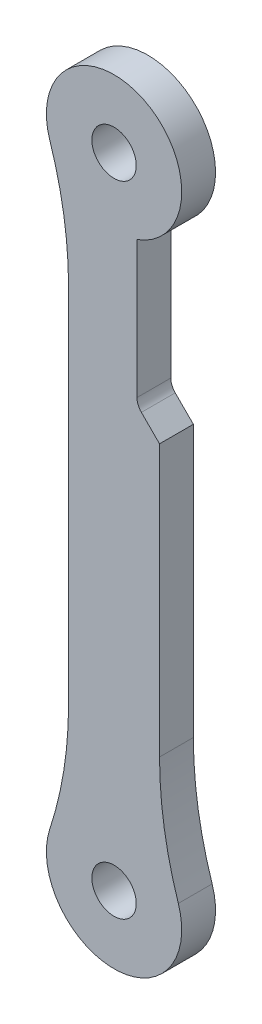
ISO-10303-21;
HEADER;
FILE_DESCRIPTION(('STEP AP214'),'2;1');
FILE_NAME('part.step','',(''),(''),'','','');
FILE_SCHEMA(('AUTOMOTIVE_DESIGN { 1 0 10303 214 1 1 1 1 }'));
ENDSEC;
DATA;
#1=APPLICATION_CONTEXT('core data for automotive mechanical design processes');
#2=APPLICATION_PROTOCOL_DEFINITION('international standard','automotive_design',2000,#1);
#3=PRODUCT_CONTEXT('',#1,'mechanical');
#4=PRODUCT('Part','Part','',(#3));
#5=PRODUCT_RELATED_PRODUCT_CATEGORY('part','',(#4));
#6=PRODUCT_DEFINITION_FORMATION('','',#4);
#7=PRODUCT_DEFINITION_CONTEXT('part definition',#1,'design');
#8=PRODUCT_DEFINITION('design','',#6,#7);
#9=PRODUCT_DEFINITION_SHAPE('','',#8);
#10=(LENGTH_UNIT() NAMED_UNIT(*) SI_UNIT(.MILLI.,.METRE.));
#11=(NAMED_UNIT(*) PLANE_ANGLE_UNIT() SI_UNIT($,.RADIAN.));
#12=(NAMED_UNIT(*) SI_UNIT($,.STERADIAN.) SOLID_ANGLE_UNIT());
#13=UNCERTAINTY_MEASURE_WITH_UNIT(LENGTH_MEASURE(1.E-05),#10,'distance_accuracy_value','');
#14=(GEOMETRIC_REPRESENTATION_CONTEXT(3) GLOBAL_UNCERTAINTY_ASSIGNED_CONTEXT((#13)) GLOBAL_UNIT_ASSIGNED_CONTEXT((#10,
#11,#12)) REPRESENTATION_CONTEXT('',''));
#15=CARTESIAN_POINT('',(0.,0.,0.));
#16=DIRECTION('',(0.,0.,1.));
#17=DIRECTION('',(1.,0.,0.));
#18=AXIS2_PLACEMENT_3D('',#15,#16,#17);
#19=CARTESIAN_POINT('',(-6.05000000000002,-42.5,-2.));
#20=DIRECTION('',(-1.,0.,0.));
#21=DIRECTION('',(0.,-1.,0.));
#22=AXIS2_PLACEMENT_3D('',#19,#20,#21);
#23=PLANE('',#22);
#24=DIRECTION('',(0.,-1.,0.));
#25=VECTOR('',#24,1.);
#26=CARTESIAN_POINT('',(-6.05000000000002,-42.5,2.5));
#27=LINE('',#26,#25);
#28=CARTESIAN_POINT('',(-6.05000000000003,24.0772559047248,2.5));
#29=VERTEX_POINT('',#28);
#30=CARTESIAN_POINT('',(-6.05000000000002,-24.0772559047248,2.5));
#31=VERTEX_POINT('',#30);
#32=EDGE_CURVE('E217',#29,#31,#27,.T.);
#33=ORIENTED_EDGE('',*,*,#32,.F.);
#34=DIRECTION('',(0.,0.,1.));
#35=VECTOR('',#34,1.);
#36=CARTESIAN_POINT('',(-6.05000000000003,24.0772559047248,-2.));
#37=LINE('',#36,#35);
#38=CARTESIAN_POINT('',(-6.05000000000003,24.0772559047248,-2.));
#39=VERTEX_POINT('',#38);
#40=EDGE_CURVE('E180',#29,#39,#37,.F.);
#41=ORIENTED_EDGE('',*,*,#40,.T.);
#42=DIRECTION('',(0.,-1.,0.));
#43=VECTOR('',#42,1.);
#44=CARTESIAN_POINT('',(-6.05000000000002,-42.5,-2.));
#45=LINE('',#44,#43);
#46=CARTESIAN_POINT('',(-6.05000000000002,-24.0772559047248,-2.));
#47=VERTEX_POINT('',#46);
#48=EDGE_CURVE('E155',#39,#47,#45,.T.);
#49=ORIENTED_EDGE('',*,*,#48,.T.);
#50=DIRECTION('',(0.,0.,1.));
#51=VECTOR('',#50,1.);
#52=CARTESIAN_POINT('',(-6.05000000000002,-24.0772559047248,2.5));
#53=LINE('',#52,#51);
#54=EDGE_CURVE('E177',#47,#31,#53,.T.);
#55=ORIENTED_EDGE('',*,*,#54,.T.);
#56=EDGE_LOOP('',(#33,#41,#49,#55));
#57=FACE_BOUND('',#56,.T.);
#58=ADVANCED_FACE('F41',(#57),#23,.T.);
#59=CARTESIAN_POINT('',(6.05000000000002,-42.5,-2.));
#60=DIRECTION('',(1.,0.,0.));
#61=DIRECTION('',(0.,1.,0.));
#62=AXIS2_PLACEMENT_3D('',#59,#60,#61);
#63=PLANE('',#62);
#64=DIRECTION('',(0.,1.,0.));
#65=VECTOR('',#64,1.);
#66=CARTESIAN_POINT('',(6.05000000000002,-42.5,2.5));
#67=LINE('',#66,#65);
#68=CARTESIAN_POINT('',(6.05000000000001,-24.0772559047248,2.5));
#69=VERTEX_POINT('',#68);
#70=CARTESIAN_POINT('',(6.05000000000001,12.,2.5));
#71=VERTEX_POINT('',#70);
#72=EDGE_CURVE('E235',#69,#71,#67,.T.);
#73=ORIENTED_EDGE('',*,*,#72,.F.);
#74=DIRECTION('',(0.,0.,1.));
#75=VECTOR('',#74,1.);
#76=CARTESIAN_POINT('',(6.05000000000001,-24.0772559047248,-2.));
#77=LINE('',#76,#75);
#78=CARTESIAN_POINT('',(6.05000000000001,-24.0772559047248,-2.));
#79=VERTEX_POINT('',#78);
#80=EDGE_CURVE('E184',#69,#79,#77,.F.);
#81=ORIENTED_EDGE('',*,*,#80,.T.);
#82=DIRECTION('',(0.,1.,0.));
#83=VECTOR('',#82,1.);
#84=CARTESIAN_POINT('',(6.05000000000002,-42.5,-2.));
#85=LINE('',#84,#83);
#86=CARTESIAN_POINT('',(6.05000000000001,12.,-2.));
#87=VERTEX_POINT('',#86);
#88=EDGE_CURVE('E162',#79,#87,#85,.T.);
#89=ORIENTED_EDGE('',*,*,#88,.T.);
#90=DIRECTION('',(0.,0.,1.));
#91=VECTOR('',#90,1.);
#92=CARTESIAN_POINT('',(6.05000000000001,12.,2.5));
#93=LINE('',#92,#91);
#94=EDGE_CURVE('E158',#87,#71,#93,.T.);
#95=ORIENTED_EDGE('',*,*,#94,.T.);
#96=EDGE_LOOP('',(#73,#81,#89,#95));
#97=FACE_BOUND('',#96,.T.);
#98=ADVANCED_FACE('F248',(#97),#63,.T.);
#99=CARTESIAN_POINT('',(0.,-42.5,-2.));
#100=DIRECTION('',(0.,0.,1.));
#101=DIRECTION('',(1.,0.,0.));
#102=AXIS2_PLACEMENT_3D('',#99,#100,#101);
#103=PLANE('',#102);
#104=ORIENTED_EDGE('',*,*,#88,.F.);
#105=CARTESIAN_POINT('',(56.05,-24.0772559047248,-2.));
#106=DIRECTION('',(0.,0.,1.));
#107=DIRECTION('',(1.,0.,0.));
#108=AXIS2_PLACEMENT_3D('',#105,#106,#107);
#109=CIRCLE('',#108,50.);
#110=CARTESIAN_POINT('',(8.55,-39.6897509007207,-2.));
#111=VERTEX_POINT('',#110);
#112=EDGE_CURVE('E68',#79,#111,#109,.T.);
#113=ORIENTED_EDGE('',*,*,#112,.T.);
#114=CARTESIAN_POINT('',(0.,-42.5,-2.));
#115=DIRECTION('',(0.,0.,-1.));
#116=DIRECTION('',(-1.,0.,0.));
#117=AXIS2_PLACEMENT_3D('',#114,#115,#116);
#118=CIRCLE('',#117,9.);
#119=CARTESIAN_POINT('',(-8.55,-39.6897509007207,-2.));
#120=VERTEX_POINT('',#119);
#121=EDGE_CURVE('E207',#111,#120,#118,.T.);
#122=ORIENTED_EDGE('',*,*,#121,.T.);
#123=CARTESIAN_POINT('',(-56.05,-24.0772559047248,-2.));
#124=DIRECTION('',(0.,0.,1.));
#125=DIRECTION('',(1.,0.,0.));
#126=AXIS2_PLACEMENT_3D('',#123,#124,#125);
#127=CIRCLE('',#126,50.);
#128=EDGE_CURVE('E50',#120,#47,#127,.T.);
#129=ORIENTED_EDGE('',*,*,#128,.T.);
#130=ORIENTED_EDGE('',*,*,#48,.F.);
#131=CARTESIAN_POINT('',(-56.05,24.0772559047248,-2.));
#132=DIRECTION('',(0.,0.,1.));
#133=DIRECTION('',(1.,0.,0.));
#134=AXIS2_PLACEMENT_3D('',#131,#132,#133);
#135=CIRCLE('',#134,50.);
#136=CARTESIAN_POINT('',(-8.55000000000002,39.6897509007207,-2.));
#137=VERTEX_POINT('',#136);
#138=EDGE_CURVE('E194',#39,#137,#135,.T.);
#139=ORIENTED_EDGE('',*,*,#138,.T.);
#140=CARTESIAN_POINT('',(0.,42.5,-2.));
#141=DIRECTION('',(0.,0.,-1.));
#142=DIRECTION('',(-1.,0.,0.));
#143=AXIS2_PLACEMENT_3D('',#140,#141,#142);
#144=CIRCLE('',#143,9.);
#145=CARTESIAN_POINT('',(3.05000000000001,34.0325623710594,-2.));
#146=VERTEX_POINT('',#145);
#147=EDGE_CURVE('E138',#137,#146,#144,.T.);
#148=ORIENTED_EDGE('',*,*,#147,.T.);
#149=DIRECTION('',(0.,1.,0.));
#150=VECTOR('',#149,1.);
#151=CARTESIAN_POINT('',(3.05000000000002,38.5,-2.));
#152=LINE('',#151,#150);
#153=CARTESIAN_POINT('',(3.05000000000001,15.8284271247462,-2.));
#154=VERTEX_POINT('',#153);
#155=EDGE_CURVE('E146',#154,#146,#152,.T.);
#156=ORIENTED_EDGE('',*,*,#155,.F.);
#157=CARTESIAN_POINT('',(5.05000000000001,15.8284271247462,-2.));
#158=DIRECTION('',(0.,0.,1.));
#159=DIRECTION('',(1.,0.,0.));
#160=AXIS2_PLACEMENT_3D('',#157,#158,#159);
#161=CIRCLE('',#160,2.);
#162=CARTESIAN_POINT('',(3.63578643762691,14.4142135623731,-2.));
#163=VERTEX_POINT('',#162);
#164=EDGE_CURVE('E174',#154,#163,#161,.T.);
#165=ORIENTED_EDGE('',*,*,#164,.T.);
#166=DIRECTION('',(0.707106781186546,-0.707106781186549,0.));
#167=VECTOR('',#166,1.);
#168=CARTESIAN_POINT('',(3.05,15.,-2.));
#169=LINE('',#168,#167);
#170=EDGE_CURVE('E154',#163,#87,#169,.T.);
#171=ORIENTED_EDGE('',*,*,#170,.T.);
#172=EDGE_LOOP('',(#104,#113,#122,#129,#130,#139,#148,#156,#165,#171));
#173=FACE_BOUND('',#172,.T.);
#174=CARTESIAN_POINT('',(0.,-42.5,-2.));
#175=DIRECTION('',(0.,0.,1.));
#176=DIRECTION('',(1.,0.,0.));
#177=AXIS2_PLACEMENT_3D('',#174,#175,#176);
#178=CIRCLE('',#177,2.95);
#179=CARTESIAN_POINT('',(2.95,-42.5,-2.));
#180=VERTEX_POINT('',#179);
#181=EDGE_CURVE('E240',#180,#180,#178,.T.);
#182=ORIENTED_EDGE('',*,*,#181,.T.);
#183=EDGE_LOOP('',(#182));
#184=FACE_BOUND('',#183,.T.);
#185=CARTESIAN_POINT('',(0.,42.5,-2.));
#186=DIRECTION('',(0.,0.,1.));
#187=DIRECTION('',(1.,0.,0.));
#188=AXIS2_PLACEMENT_3D('',#185,#186,#187);
#189=CIRCLE('',#188,2.95);
#190=CARTESIAN_POINT('',(2.94999999999999,42.5,-2.));
#191=VERTEX_POINT('',#190);
#192=EDGE_CURVE('E243',#191,#191,#189,.T.);
#193=ORIENTED_EDGE('',*,*,#192,.T.);
#194=EDGE_LOOP('',(#193));
#195=FACE_BOUND('',#194,.T.);
#196=ADVANCED_FACE('F205',(#173,#184,#195),#103,.F.);
#197=CARTESIAN_POINT('',(0.,42.5,-2.));
#198=DIRECTION('',(0.,0.,1.));
#199=DIRECTION('',(1.,0.,0.));
#200=AXIS2_PLACEMENT_3D('',#197,#198,#199);
#201=CYLINDRICAL_SURFACE('',#200,2.95);
#202=ORIENTED_EDGE('',*,*,#192,.F.);
#203=EDGE_LOOP('',(#202));
#204=FACE_BOUND('',#203,.T.);
#205=CARTESIAN_POINT('',(0.,42.5,2.5));
#206=DIRECTION('',(0.,0.,1.));
#207=DIRECTION('',(1.,0.,0.));
#208=AXIS2_PLACEMENT_3D('',#205,#206,#207);
#209=CIRCLE('',#208,2.95);
#210=CARTESIAN_POINT('',(2.94999999999999,42.5,2.5));
#211=VERTEX_POINT('',#210);
#212=EDGE_CURVE('E232',#211,#211,#209,.T.);
#213=ORIENTED_EDGE('',*,*,#212,.T.);
#214=EDGE_LOOP('',(#213));
#215=FACE_BOUND('',#214,.T.);
#216=ADVANCED_FACE('F294',(#204,#215),#201,.F.);
#217=CARTESIAN_POINT('',(0.,-42.5,-2.));
#218=DIRECTION('',(0.,0.,1.));
#219=DIRECTION('',(1.,0.,0.));
#220=AXIS2_PLACEMENT_3D('',#217,#218,#219);
#221=CYLINDRICAL_SURFACE('',#220,2.95);
#222=ORIENTED_EDGE('',*,*,#181,.F.);
#223=EDGE_LOOP('',(#222));
#224=FACE_BOUND('',#223,.T.);
#225=CARTESIAN_POINT('',(0.,-42.5,2.5));
#226=DIRECTION('',(0.,0.,1.));
#227=DIRECTION('',(1.,0.,0.));
#228=AXIS2_PLACEMENT_3D('',#225,#226,#227);
#229=CIRCLE('',#228,2.95);
#230=CARTESIAN_POINT('',(2.95,-42.5,2.5));
#231=VERTEX_POINT('',#230);
#232=EDGE_CURVE('E229',#231,#231,#229,.T.);
#233=ORIENTED_EDGE('',*,*,#232,.T.);
#234=EDGE_LOOP('',(#233));
#235=FACE_BOUND('',#234,.T.);
#236=ADVANCED_FACE('F292',(#224,#235),#221,.F.);
#237=CARTESIAN_POINT('',(0.,-42.5,2.5));
#238=DIRECTION('',(0.,0.,1.));
#239=DIRECTION('',(1.,0.,0.));
#240=AXIS2_PLACEMENT_3D('',#237,#238,#239);
#241=PLANE('',#240);
#242=CARTESIAN_POINT('',(0.,42.5,2.5));
#243=DIRECTION('',(0.,0.,1.));
#244=DIRECTION('',(1.,0.,0.));
#245=AXIS2_PLACEMENT_3D('',#242,#243,#244);
#246=CIRCLE('',#245,9.);
#247=CARTESIAN_POINT('',(-8.55000000000002,39.6897509007207,2.5));
#248=VERTEX_POINT('',#247);
#249=CARTESIAN_POINT('',(3.05000000000001,34.0325623710594,2.5));
#250=VERTEX_POINT('',#249);
#251=EDGE_CURVE('E127',#248,#250,#246,.F.);
#252=ORIENTED_EDGE('',*,*,#251,.F.);
#253=CARTESIAN_POINT('',(-56.05,24.0772559047248,2.5));
#254=DIRECTION('',(0.,0.,1.));
#255=DIRECTION('',(1.,0.,0.));
#256=AXIS2_PLACEMENT_3D('',#253,#254,#255);
#257=CIRCLE('',#256,50.);
#258=EDGE_CURVE('E196',#248,#29,#257,.F.);
#259=ORIENTED_EDGE('',*,*,#258,.T.);
#260=ORIENTED_EDGE('',*,*,#32,.T.);
#261=CARTESIAN_POINT('',(-56.05,-24.0772559047248,2.5));
#262=DIRECTION('',(0.,0.,1.));
#263=DIRECTION('',(1.,0.,0.));
#264=AXIS2_PLACEMENT_3D('',#261,#262,#263);
#265=CIRCLE('',#264,50.);
#266=CARTESIAN_POINT('',(-8.55,-39.6897509007207,2.5));
#267=VERTEX_POINT('',#266);
#268=EDGE_CURVE('E11',#31,#267,#265,.F.);
#269=ORIENTED_EDGE('',*,*,#268,.T.);
#270=CARTESIAN_POINT('',(0.,-42.5,2.5));
#271=DIRECTION('',(0.,0.,1.));
#272=DIRECTION('',(1.,0.,0.));
#273=AXIS2_PLACEMENT_3D('',#270,#271,#272);
#274=CIRCLE('',#273,9.);
#275=CARTESIAN_POINT('',(8.55,-39.6897509007207,2.5));
#276=VERTEX_POINT('',#275);
#277=EDGE_CURVE('E215',#276,#267,#274,.F.);
#278=ORIENTED_EDGE('',*,*,#277,.F.);
#279=CARTESIAN_POINT('',(56.05,-24.0772559047248,2.5));
#280=DIRECTION('',(0.,0.,1.));
#281=DIRECTION('',(1.,0.,0.));
#282=AXIS2_PLACEMENT_3D('',#279,#280,#281);
#283=CIRCLE('',#282,50.);
#284=EDGE_CURVE('E200',#276,#69,#283,.F.);
#285=ORIENTED_EDGE('',*,*,#284,.T.);
#286=ORIENTED_EDGE('',*,*,#72,.T.);
#287=DIRECTION('',(-0.707106781186546,0.707106781186549,0.));
#288=VECTOR('',#287,1.);
#289=CARTESIAN_POINT('',(30.275,-12.2250000000001,2.5));
#290=LINE('',#289,#288);
#291=CARTESIAN_POINT('',(3.63578643762691,14.4142135623731,2.5));
#292=VERTEX_POINT('',#291);
#293=EDGE_CURVE('E168',#71,#292,#290,.T.);
#294=ORIENTED_EDGE('',*,*,#293,.T.);
#295=CARTESIAN_POINT('',(5.05000000000001,15.8284271247462,2.5));
#296=DIRECTION('',(0.,0.,1.));
#297=DIRECTION('',(1.,0.,0.));
#298=AXIS2_PLACEMENT_3D('',#295,#296,#297);
#299=CIRCLE('',#298,2.);
#300=CARTESIAN_POINT('',(3.05000000000001,15.8284271247462,2.5));
#301=VERTEX_POINT('',#300);
#302=EDGE_CURVE('E152',#292,#301,#299,.F.);
#303=ORIENTED_EDGE('',*,*,#302,.T.);
#304=DIRECTION('',(0.,-1.,0.));
#305=VECTOR('',#304,1.);
#306=CARTESIAN_POINT('',(3.05000000000001,-42.5,2.5));
#307=LINE('',#306,#305);
#308=EDGE_CURVE('E143',#250,#301,#307,.T.);
#309=ORIENTED_EDGE('',*,*,#308,.F.);
#310=EDGE_LOOP('',(#252,#259,#260,#269,#278,#285,#286,#294,#303,#309));
#311=FACE_BOUND('',#310,.T.);
#312=ORIENTED_EDGE('',*,*,#212,.F.);
#313=EDGE_LOOP('',(#312));
#314=FACE_BOUND('',#313,.T.);
#315=ORIENTED_EDGE('',*,*,#232,.F.);
#316=EDGE_LOOP('',(#315));
#317=FACE_BOUND('',#316,.T.);
#318=ADVANCED_FACE('F148',(#311,#314,#317),#241,.T.);
#319=CARTESIAN_POINT('',(3.05000000000002,38.5,8.));
#320=DIRECTION('',(-1.,0.,0.));
#321=DIRECTION('',(0.,-1.,0.));
#322=AXIS2_PLACEMENT_3D('',#319,#320,#321);
#323=PLANE('',#322);
#324=ORIENTED_EDGE('',*,*,#155,.T.);
#325=DIRECTION('',(0.,0.,-1.));
#326=VECTOR('',#325,1.);
#327=CARTESIAN_POINT('',(3.05000000000001,34.0325623710594,27.5820927619872));
#328=LINE('',#327,#326);
#329=EDGE_CURVE('E131',#250,#146,#328,.T.);
#330=ORIENTED_EDGE('',*,*,#329,.F.);
#331=ORIENTED_EDGE('',*,*,#308,.T.);
#332=DIRECTION('',(0.,0.,-1.));
#333=VECTOR('',#332,1.);
#334=CARTESIAN_POINT('',(3.05000000000001,15.8284271247462,8.));
#335=LINE('',#334,#333);
#336=EDGE_CURVE('E170',#301,#154,#335,.T.);
#337=ORIENTED_EDGE('',*,*,#336,.T.);
#338=EDGE_LOOP('',(#324,#330,#331,#337));
#339=FACE_BOUND('',#338,.T.);
#340=ADVANCED_FACE('F141',(#339),#323,.F.);
#341=CARTESIAN_POINT('',(3.05,15.,8.));
#342=DIRECTION('',(0.707106781186549,0.707106781186546,0.));
#343=DIRECTION('',(-0.707106781186546,0.707106781186549,0.));
#344=AXIS2_PLACEMENT_3D('',#341,#342,#343);
#345=PLANE('',#344);
#346=ORIENTED_EDGE('',*,*,#170,.F.);
#347=DIRECTION('',(0.,0.,-1.));
#348=VECTOR('',#347,1.);
#349=CARTESIAN_POINT('',(3.63578643762691,14.4142135623731,8.));
#350=LINE('',#349,#348);
#351=EDGE_CURVE('E172',#163,#292,#350,.F.);
#352=ORIENTED_EDGE('',*,*,#351,.T.);
#353=ORIENTED_EDGE('',*,*,#293,.F.);
#354=ORIENTED_EDGE('',*,*,#94,.F.);
#355=EDGE_LOOP('',(#346,#352,#353,#354));
#356=FACE_BOUND('',#355,.T.);
#357=ADVANCED_FACE('F255',(#356),#345,.T.);
#358=CARTESIAN_POINT('',(5.05000000000001,15.8284271247462,8.));
#359=DIRECTION('',(0.,0.,-1.));
#360=DIRECTION('',(-1.,0.,0.));
#361=AXIS2_PLACEMENT_3D('',#358,#359,#360);
#362=CYLINDRICAL_SURFACE('',#361,2.);
#363=ORIENTED_EDGE('',*,*,#302,.F.);
#364=ORIENTED_EDGE('',*,*,#351,.F.);
#365=ORIENTED_EDGE('',*,*,#164,.F.);
#366=ORIENTED_EDGE('',*,*,#336,.F.);
#367=EDGE_LOOP('',(#363,#364,#365,#366));
#368=FACE_BOUND('',#367,.T.);
#369=ADVANCED_FACE('F257',(#368),#362,.F.);
#370=CARTESIAN_POINT('',(0.,42.5,27.5820927619872));
#371=DIRECTION('',(0.,0.,-1.));
#372=DIRECTION('',(-1.,0.,0.));
#373=AXIS2_PLACEMENT_3D('',#370,#371,#372);
#374=CYLINDRICAL_SURFACE('',#373,9.);
#375=ORIENTED_EDGE('',*,*,#147,.F.);
#376=DIRECTION('',(0.,0.,-1.));
#377=VECTOR('',#376,1.);
#378=CARTESIAN_POINT('',(-8.55000000000002,39.6897509007207,27.5820927619872));
#379=LINE('',#378,#377);
#380=EDGE_CURVE('E134',#137,#248,#379,.F.);
#381=ORIENTED_EDGE('',*,*,#380,.T.);
#382=ORIENTED_EDGE('',*,*,#251,.T.);
#383=ORIENTED_EDGE('',*,*,#329,.T.);
#384=EDGE_LOOP('',(#375,#381,#382,#383));
#385=FACE_BOUND('',#384,.T.);
#386=ADVANCED_FACE('F130',(#385),#374,.T.);
#387=CARTESIAN_POINT('',(0.,-42.5,27.5820927619872));
#388=DIRECTION('',(0.,0.,-1.));
#389=DIRECTION('',(-1.,0.,0.));
#390=AXIS2_PLACEMENT_3D('',#387,#388,#389);
#391=CYLINDRICAL_SURFACE('',#390,9.);
#392=ORIENTED_EDGE('',*,*,#121,.F.);
#393=DIRECTION('',(0.,0.,-1.));
#394=VECTOR('',#393,1.);
#395=CARTESIAN_POINT('',(8.55,-39.6897509007207,27.5820927619872));
#396=LINE('',#395,#394);
#397=EDGE_CURVE('E191',#111,#276,#396,.F.);
#398=ORIENTED_EDGE('',*,*,#397,.T.);
#399=ORIENTED_EDGE('',*,*,#277,.T.);
#400=DIRECTION('',(0.,0.,-1.));
#401=VECTOR('',#400,1.);
#402=CARTESIAN_POINT('',(-8.55,-39.6897509007207,27.5820927619872));
#403=LINE('',#402,#401);
#404=EDGE_CURVE('E188',#267,#120,#403,.T.);
#405=ORIENTED_EDGE('',*,*,#404,.T.);
#406=EDGE_LOOP('',(#392,#398,#399,#405));
#407=FACE_BOUND('',#406,.T.);
#408=ADVANCED_FACE('F219',(#407),#391,.T.);
#409=CARTESIAN_POINT('',(-56.05,24.0772559047248,27.5820927619872));
#410=DIRECTION('',(0.,0.,-1.));
#411=DIRECTION('',(-1.,0.,0.));
#412=AXIS2_PLACEMENT_3D('',#409,#410,#411);
#413=CYLINDRICAL_SURFACE('',#412,50.);
#414=ORIENTED_EDGE('',*,*,#258,.F.);
#415=ORIENTED_EDGE('',*,*,#380,.F.);
#416=ORIENTED_EDGE('',*,*,#138,.F.);
#417=ORIENTED_EDGE('',*,*,#40,.F.);
#418=EDGE_LOOP('',(#414,#415,#416,#417));
#419=FACE_BOUND('',#418,.T.);
#420=ADVANCED_FACE('F259',(#419),#413,.F.);
#421=CARTESIAN_POINT('',(56.05,-24.0772559047248,27.5820927619872));
#422=DIRECTION('',(0.,0.,-1.));
#423=DIRECTION('',(-1.,0.,0.));
#424=AXIS2_PLACEMENT_3D('',#421,#422,#423);
#425=CYLINDRICAL_SURFACE('',#424,50.);
#426=ORIENTED_EDGE('',*,*,#284,.F.);
#427=ORIENTED_EDGE('',*,*,#397,.F.);
#428=ORIENTED_EDGE('',*,*,#112,.F.);
#429=ORIENTED_EDGE('',*,*,#80,.F.);
#430=EDGE_LOOP('',(#426,#427,#428,#429));
#431=FACE_BOUND('',#430,.T.);
#432=ADVANCED_FACE('F261',(#431),#425,.F.);
#433=CARTESIAN_POINT('',(-56.05,-24.0772559047248,27.5820927619872));
#434=DIRECTION('',(0.,0.,-1.));
#435=DIRECTION('',(-1.,0.,0.));
#436=AXIS2_PLACEMENT_3D('',#433,#434,#435);
#437=CYLINDRICAL_SURFACE('',#436,50.);
#438=ORIENTED_EDGE('',*,*,#268,.F.);
#439=ORIENTED_EDGE('',*,*,#54,.F.);
#440=ORIENTED_EDGE('',*,*,#128,.F.);
#441=ORIENTED_EDGE('',*,*,#404,.F.);
#442=EDGE_LOOP('',(#438,#439,#440,#441));
#443=FACE_BOUND('',#442,.T.);
#444=ADVANCED_FACE('F43',(#443),#437,.F.);
#445=CLOSED_SHELL('',(#58,#98,#196,#216,#236,#318,#340,#357,#369,#386,#408,#420,#432,#444));
#446=MANIFOLD_SOLID_BREP('B2',#445);
#447=ADVANCED_BREP_SHAPE_REPRESENTATION('',(#18,#446),#14);
#448=SHAPE_DEFINITION_REPRESENTATION(#9,#447);
ENDSEC;
END-ISO-10303-21;
